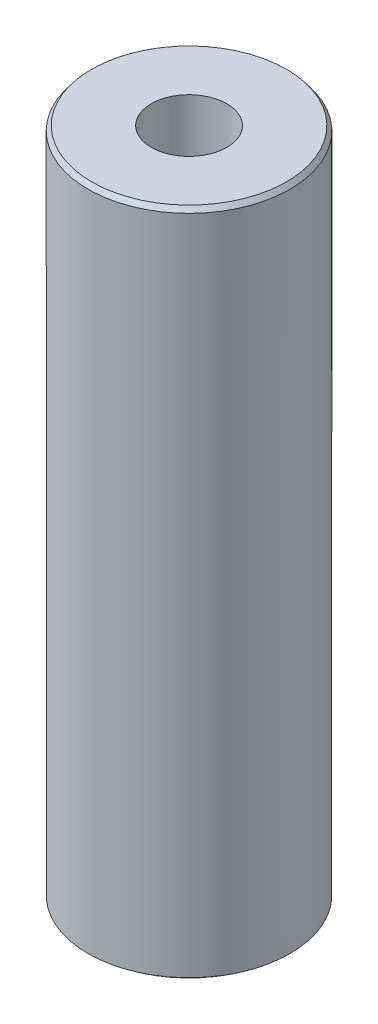
ISO-10303-21;
HEADER;
FILE_DESCRIPTION(('STEP AP214'),'2;1');
FILE_NAME('part.step','',(''),(''),'','','');
FILE_SCHEMA(('AUTOMOTIVE_DESIGN { 1 0 10303 214 1 1 1 1 }'));
ENDSEC;
DATA;
#1=APPLICATION_CONTEXT('core data for automotive mechanical design processes');
#2=APPLICATION_PROTOCOL_DEFINITION('international standard','automotive_design',2000,#1);
#3=PRODUCT_CONTEXT('',#1,'mechanical');
#4=PRODUCT('Part','Part','',(#3));
#5=PRODUCT_RELATED_PRODUCT_CATEGORY('part','',(#4));
#6=PRODUCT_DEFINITION_FORMATION('','',#4);
#7=PRODUCT_DEFINITION_CONTEXT('part definition',#1,'design');
#8=PRODUCT_DEFINITION('design','',#6,#7);
#9=PRODUCT_DEFINITION_SHAPE('','',#8);
#10=(LENGTH_UNIT() NAMED_UNIT(*) SI_UNIT(.MILLI.,.METRE.));
#11=(NAMED_UNIT(*) PLANE_ANGLE_UNIT() SI_UNIT($,.RADIAN.));
#12=(NAMED_UNIT(*) SI_UNIT($,.STERADIAN.) SOLID_ANGLE_UNIT());
#13=UNCERTAINTY_MEASURE_WITH_UNIT(LENGTH_MEASURE(1.E-05),#10,'distance_accuracy_value','');
#14=(GEOMETRIC_REPRESENTATION_CONTEXT(3) GLOBAL_UNCERTAINTY_ASSIGNED_CONTEXT((#13)) GLOBAL_UNIT_ASSIGNED_CONTEXT((#10,
#11,#12)) REPRESENTATION_CONTEXT('',''));
#15=CARTESIAN_POINT('',(0.,0.,0.));
#16=DIRECTION('',(0.,0.,1.));
#17=DIRECTION('',(1.,0.,0.));
#18=AXIS2_PLACEMENT_3D('',#15,#16,#17);
#19=CARTESIAN_POINT('',(0.,298.553097520889,0.));
#20=DIRECTION('',(0.,-1.,0.));
#21=DIRECTION('',(0.,0.,-1.));
#22=AXIS2_PLACEMENT_3D('',#19,#20,#21);
#23=CYLINDRICAL_SURFACE('',#22,45.);
#24=CARTESIAN_POINT('',(0.,296.481665164193,0.));
#25=DIRECTION('',(0.,1.,0.));
#26=DIRECTION('',(0.,0.,1.));
#27=AXIS2_PLACEMENT_3D('',#24,#25,#26);
#28=CIRCLE('',#27,45.);
#29=CARTESIAN_POINT('',(0.,296.481665164193,-45.));
#30=VERTEX_POINT('',#29);
#31=EDGE_CURVE('E50',#30,#30,#28,.F.);
#32=CARTESIAN_POINT('',(0.,1.57807452334624,0.));
#33=DIRECTION('',(0.,1.,0.));
#34=DIRECTION('',(0.,0.,1.));
#35=AXIS2_PLACEMENT_3D('',#32,#33,#34);
#36=CIRCLE('',#35,45.);
#37=CARTESIAN_POINT('',(0.,1.57807452334624,-45.));
#38=VERTEX_POINT('',#37);
#39=EDGE_CURVE('E51',#38,#38,#36,.T.);
#40=CARTESIAN_POINT('',(0.,296.481665164193,-45.));
#41=CARTESIAN_POINT('',(0.,293.409752761684,-45.));
#42=CARTESIAN_POINT('',(0.,290.337840359176,-45.));
#43=CARTESIAN_POINT('',(0.,284.194015554158,-45.));
#44=CARTESIAN_POINT('',(0.,281.122103151649,-45.));
#45=CARTESIAN_POINT('',(0.,274.978278346631,-45.));
#46=CARTESIAN_POINT('',(0.,271.906365944123,-45.));
#47=CARTESIAN_POINT('',(0.,265.762541139105,-45.));
#48=CARTESIAN_POINT('',(0.,262.690628736596,-45.));
#49=CARTESIAN_POINT('',(0.,256.546803931579,-45.));
#50=CARTESIAN_POINT('',(0.,253.47489152907,-45.));
#51=CARTESIAN_POINT('',(0.,247.331066724052,-45.));
#52=CARTESIAN_POINT('',(0.,244.259154321543,-45.));
#53=CARTESIAN_POINT('',(0.,238.115329516526,-45.));
#54=CARTESIAN_POINT('',(0.,235.043417114017,-45.));
#55=CARTESIAN_POINT('',(0.,228.899592308999,-45.));
#56=CARTESIAN_POINT('',(0.,225.82767990649,-45.));
#57=CARTESIAN_POINT('',(0.,219.683855101473,-45.));
#58=CARTESIAN_POINT('',(0.,216.611942698964,-45.));
#59=CARTESIAN_POINT('',(0.,210.468117893946,-45.));
#60=CARTESIAN_POINT('',(0.,207.396205491437,-45.));
#61=CARTESIAN_POINT('',(0.,201.25238068642,-45.));
#62=CARTESIAN_POINT('',(0.,198.180468283911,-45.));
#63=CARTESIAN_POINT('',(0.,192.036643478893,-45.));
#64=CARTESIAN_POINT('',(0.,188.964731076384,-45.));
#65=CARTESIAN_POINT('',(0.,182.820906271367,-45.));
#66=CARTESIAN_POINT('',(0.,179.748993868858,-45.));
#67=CARTESIAN_POINT('',(0.,173.60516906384,-45.));
#68=CARTESIAN_POINT('',(0.,170.533256661331,-45.));
#69=CARTESIAN_POINT('',(0.,164.389431856314,-45.));
#70=CARTESIAN_POINT('',(0.,161.317519453805,-45.));
#71=CARTESIAN_POINT('',(0.,155.173694648787,-45.));
#72=CARTESIAN_POINT('',(0.,152.101782246279,-45.));
#73=CARTESIAN_POINT('',(0.,145.957957441261,-45.));
#74=CARTESIAN_POINT('',(0.,142.886045038752,-45.));
#75=CARTESIAN_POINT('',(0.,136.742220233734,-45.));
#76=CARTESIAN_POINT('',(0.,133.670307831226,-45.));
#77=CARTESIAN_POINT('',(0.,127.526483026208,-45.));
#78=CARTESIAN_POINT('',(0.,124.454570623699,-45.));
#79=CARTESIAN_POINT('',(0.,118.310745818681,-45.));
#80=CARTESIAN_POINT('',(0.,115.238833416173,-45.));
#81=CARTESIAN_POINT('',(0.,109.095008611155,-45.));
#82=CARTESIAN_POINT('',(0.,106.023096208646,-45.));
#83=CARTESIAN_POINT('',(0.,99.8792714036285,-45.));
#84=CARTESIAN_POINT('',(0.,96.8073590011197,-45.));
#85=CARTESIAN_POINT('',(0.,90.663534196102,-45.));
#86=CARTESIAN_POINT('',(0.,87.5916217935932,-45.));
#87=CARTESIAN_POINT('',(0.,81.4477969885756,-45.));
#88=CARTESIAN_POINT('',(0.,78.3758845860668,-45.));
#89=CARTESIAN_POINT('',(0.,72.2320597810491,-45.));
#90=CARTESIAN_POINT('',(0.,69.1601473785403,-45.));
#91=CARTESIAN_POINT('',(0.,63.0163225735226,-45.));
#92=CARTESIAN_POINT('',(0.,59.9444101710138,-45.));
#93=CARTESIAN_POINT('',(0.,53.8005853659962,-45.));
#94=CARTESIAN_POINT('',(0.,50.7286729634874,-45.));
#95=CARTESIAN_POINT('',(0.,44.5848481584697,-45.));
#96=CARTESIAN_POINT('',(0.,41.5129357559609,-45.));
#97=CARTESIAN_POINT('',(0.,35.3691109509433,-45.));
#98=CARTESIAN_POINT('',(0.,32.2971985484345,-45.));
#99=CARTESIAN_POINT('',(0.,26.1533737434168,-45.));
#100=CARTESIAN_POINT('',(0.,23.081461340908,-45.));
#101=CARTESIAN_POINT('',(0.,16.9376365358903,-45.));
#102=CARTESIAN_POINT('',(0.,13.8657241333815,-45.));
#103=CARTESIAN_POINT('',(0.,7.72189932836387,-45.));
#104=CARTESIAN_POINT('',(0.,4.64998692585506,-45.));
#105=CARTESIAN_POINT('',(0.,1.57807452334624,-45.));
#106=B_SPLINE_CURVE_WITH_KNOTS('',3,(#40,#41,#42,#43,#44,#45,#46,#47,#48,#49,#50,#51,#52,#53,
#54,#55,#56,#57,#58,#59,#60,#61,#62,#63,#64,#65,#66,#67,#68,#69,#70,#71,#72,#73,#74,#75,#76,#77,
#78,#79,#80,#81,#82,#83,#84,#85,#86,#87,#88,#89,#90,#91,#92,#93,#94,#95,#96,#97,#98,#99,#100,
#101,#102,#103,#104,#105),.UNSPECIFIED.,.F.,.F.,(4,2,2,2,2,2,2,2,2,2,2,2,2,2,2,2,2,2,2,2,2,2,2,
2,2,2,2,2,2,2,2,2,4),(0.,9.2157372075265,18.4314744150529,27.6472116225794,36.8629488301059,
46.0786860376324,55.2944232451588,64.5101604526853,73.7258976602118,82.9416348677383,
92.1573720752647,101.373109282791,110.588846490318,119.804583697844,129.020320905371,
138.236058112897,147.451795320424,156.66753252795,165.883269735476,175.099006943003,
184.314744150529,193.530481358056,202.746218565582,211.961955773109,221.177692980635,
230.393430188162,239.609167395688,248.824904603215,258.040641810741,267.256379018268,
276.472116225794,285.687853433321,294.903590640847),.UNSPECIFIED.);
#107=EDGE_CURVE('BSEAM39',#30,#38,#106,.T.);
#108=ORIENTED_EDGE('',*,*,#31,.T.);
#109=ORIENTED_EDGE('',*,*,#39,.T.);
#110=ORIENTED_EDGE('',*,*,#107,.T.);
#111=ORIENTED_EDGE('',*,*,#107,.F.);
#112=EDGE_LOOP('',(#108,#110,#109,#111));
#113=FACE_BOUND('',#112,.T.);
#114=ADVANCED_FACE('F39',(#113),#23,.T.);
#115=CARTESIAN_POINT('',(0.,298.553097520889,0.));
#116=DIRECTION('',(0.,1.,0.));
#117=DIRECTION('',(0.,0.,1.));
#118=AXIS2_PLACEMENT_3D('',#115,#116,#117);
#119=PLANE('',#118);
#120=CARTESIAN_POINT('',(0.,298.553097520889,0.));
#121=DIRECTION('',(0.,1.,0.));
#122=DIRECTION('',(0.,0.,1.));
#123=AXIS2_PLACEMENT_3D('',#120,#121,#122);
#124=CIRCLE('',#123,43.4219254766541);
#125=CARTESIAN_POINT('',(0.,298.553097520889,43.4219254766541));
#126=VERTEX_POINT('',#125);
#127=EDGE_CURVE('E54',#126,#126,#124,.T.);
#128=ORIENTED_EDGE('',*,*,#127,.T.);
#129=EDGE_LOOP('',(#128));
#130=FACE_BOUND('',#129,.T.);
#131=CARTESIAN_POINT('',(0.,298.553097520889,0.));
#132=DIRECTION('',(0.,1.,0.));
#133=DIRECTION('',(0.,0.,1.));
#134=AXIS2_PLACEMENT_3D('',#131,#132,#133);
#135=CIRCLE('',#134,16.8477990437032);
#136=CARTESIAN_POINT('',(0.,298.553097520889,-16.8477990437032));
#137=VERTEX_POINT('',#136);
#138=EDGE_CURVE('E58',#137,#137,#135,.T.);
#139=ORIENTED_EDGE('',*,*,#138,.F.);
#140=EDGE_LOOP('',(#139));
#141=FACE_BOUND('',#140,.T.);
#142=ADVANCED_FACE('F69',(#130,#141),#119,.T.);
#143=CARTESIAN_POINT('',(0.,0.,0.));
#144=DIRECTION('',(0.,1.,0.));
#145=DIRECTION('',(0.,0.,1.));
#146=AXIS2_PLACEMENT_3D('',#143,#144,#145);
#147=PLANE('',#146);
#148=CARTESIAN_POINT('',(0.,0.,0.));
#149=DIRECTION('',(0.,1.,0.));
#150=DIRECTION('',(0.,0.,1.));
#151=AXIS2_PLACEMENT_3D('',#148,#149,#150);
#152=CIRCLE('',#151,42.9285676433034);
#153=CARTESIAN_POINT('',(0.,0.,42.9285676433034));
#154=VERTEX_POINT('',#153);
#155=EDGE_CURVE('E10',#154,#154,#152,.F.);
#156=ORIENTED_EDGE('',*,*,#155,.T.);
#157=EDGE_LOOP('',(#156));
#158=FACE_BOUND('',#157,.T.);
#159=CARTESIAN_POINT('',(0.,0.,0.));
#160=DIRECTION('',(0.,1.,0.));
#161=DIRECTION('',(0.,0.,1.));
#162=AXIS2_PLACEMENT_3D('',#159,#160,#161);
#163=CIRCLE('',#162,16.8477990437032);
#164=CARTESIAN_POINT('',(0.,0.,-16.8477990437032));
#165=VERTEX_POINT('',#164);
#166=EDGE_CURVE('E63',#165,#165,#163,.T.);
#167=ORIENTED_EDGE('',*,*,#166,.T.);
#168=EDGE_LOOP('',(#167));
#169=FACE_BOUND('',#168,.T.);
#170=ADVANCED_FACE('F75',(#158,#169),#147,.F.);
#171=CARTESIAN_POINT('',(0.,298.553097520889,0.));
#172=DIRECTION('',(0.,-1.,0.));
#173=DIRECTION('',(0.,0.,-1.));
#174=AXIS2_PLACEMENT_3D('',#171,#172,#173);
#175=CYLINDRICAL_SURFACE('',#174,16.8477990437032);
#176=CARTESIAN_POINT('',(0.,298.553097520889,-16.8477990437032));
#177=CARTESIAN_POINT('',(0.,295.443169421713,-16.8477990437032));
#178=CARTESIAN_POINT('',(0.,292.333241322537,-16.8477990437032));
#179=CARTESIAN_POINT('',(0.,286.113385124186,-16.8477990437032));
#180=CARTESIAN_POINT('',(0.,283.00345702501,-16.8477990437032));
#181=CARTESIAN_POINT('',(0.,276.783600826658,-16.8477990437032));
#182=CARTESIAN_POINT('',(0.,273.673672727482,-16.8477990437032));
#183=CARTESIAN_POINT('',(0.,267.45381652913,-16.8477990437032));
#184=CARTESIAN_POINT('',(0.,264.343888429954,-16.8477990437032));
#185=CARTESIAN_POINT('',(0.,258.124032231602,-16.8477990437032));
#186=CARTESIAN_POINT('',(0.,255.014104132426,-16.8477990437032));
#187=CARTESIAN_POINT('',(0.,248.794247934074,-16.8477990437032));
#188=CARTESIAN_POINT('',(0.,245.684319834899,-16.8477990437032));
#189=CARTESIAN_POINT('',(0.,239.464463636547,-16.8477990437032));
#190=CARTESIAN_POINT('',(0.,236.354535537371,-16.8477990437032));
#191=CARTESIAN_POINT('',(0.,230.134679339019,-16.8477990437032));
#192=CARTESIAN_POINT('',(0.,227.024751239843,-16.8477990437032));
#193=CARTESIAN_POINT('',(0.,220.804895041491,-16.8477990437032));
#194=CARTESIAN_POINT('',(0.,217.694966942315,-16.8477990437032));
#195=CARTESIAN_POINT('',(0.,211.475110743963,-16.8477990437032));
#196=CARTESIAN_POINT('',(0.,208.365182644787,-16.8477990437032));
#197=CARTESIAN_POINT('',(0.,202.145326446436,-16.8477990437032));
#198=CARTESIAN_POINT('',(0.,199.03539834726,-16.8477990437032));
#199=CARTESIAN_POINT('',(0.,192.815542148908,-16.8477990437032));
#200=CARTESIAN_POINT('',(0.,189.705614049732,-16.8477990437032));
#201=CARTESIAN_POINT('',(0.,183.48575785138,-16.8477990437032));
#202=CARTESIAN_POINT('',(0.,180.375829752204,-16.8477990437032));
#203=CARTESIAN_POINT('',(0.,174.155973553852,-16.8477990437032));
#204=CARTESIAN_POINT('',(0.,171.046045454676,-16.8477990437032));
#205=CARTESIAN_POINT('',(0.,164.826189256324,-16.8477990437032));
#206=CARTESIAN_POINT('',(0.,161.716261157148,-16.8477990437032));
#207=CARTESIAN_POINT('',(0.,155.496404958797,-16.8477990437032));
#208=CARTESIAN_POINT('',(0.,152.386476859621,-16.8477990437032));
#209=CARTESIAN_POINT('',(0.,146.166620661269,-16.8477990437032));
#210=CARTESIAN_POINT('',(0.,143.056692562093,-16.8477990437032));
#211=CARTESIAN_POINT('',(0.,136.836836363741,-16.8477990437032));
#212=CARTESIAN_POINT('',(0.,133.726908264565,-16.8477990437032));
#213=CARTESIAN_POINT('',(0.,127.507052066213,-16.8477990437032));
#214=CARTESIAN_POINT('',(0.,124.397123967037,-16.8477990437032));
#215=CARTESIAN_POINT('',(0.,118.177267768685,-16.8477990437032));
#216=CARTESIAN_POINT('',(0.,115.067339669509,-16.8477990437032));
#217=CARTESIAN_POINT('',(0.,108.847483471158,-16.8477990437032));
#218=CARTESIAN_POINT('',(0.,105.737555371982,-16.8477990437032));
#219=CARTESIAN_POINT('',(0.,99.5176991736298,-16.8477990437032));
#220=CARTESIAN_POINT('',(0.,96.4077710744539,-16.8477990437032));
#221=CARTESIAN_POINT('',(0.,90.187914876102,-16.8477990437032));
#222=CARTESIAN_POINT('',(0.,87.0779867769261,-16.8477990437032));
#223=CARTESIAN_POINT('',(0.,80.8581305785742,-16.8477990437032));
#224=CARTESIAN_POINT('',(0.,77.7482024793983,-16.8477990437032));
#225=CARTESIAN_POINT('',(0.,71.5283462810464,-16.8477990437032));
#226=CARTESIAN_POINT('',(0.,68.4184181818705,-16.8477990437032));
#227=CARTESIAN_POINT('',(0.,62.1985619835186,-16.8477990437032));
#228=CARTESIAN_POINT('',(0.,59.0886338843427,-16.8477990437032));
#229=CARTESIAN_POINT('',(0.,52.8687776859908,-16.8477990437032));
#230=CARTESIAN_POINT('',(0.,49.7588495868149,-16.8477990437032));
#231=CARTESIAN_POINT('',(0.,43.538993388463,-16.8477990437032));
#232=CARTESIAN_POINT('',(0.,40.4290652892871,-16.8477990437032));
#233=CARTESIAN_POINT('',(0.,34.2092090909352,-16.8477990437032));
#234=CARTESIAN_POINT('',(0.,31.0992809917593,-16.8477990437032));
#235=CARTESIAN_POINT('',(0.,24.8794247934074,-16.8477990437032));
#236=CARTESIAN_POINT('',(0.,21.7694966942315,-16.8477990437032));
#237=CARTESIAN_POINT('',(0.,15.5496404958796,-16.8477990437032));
#238=CARTESIAN_POINT('',(0.,12.4397123967037,-16.8477990437032));
#239=CARTESIAN_POINT('',(0.,6.21985619835186,-16.8477990437032));
#240=CARTESIAN_POINT('',(0.,3.10992809917593,-16.8477990437032));
#241=CARTESIAN_POINT('',(0.,0.,-16.8477990437032));
#242=B_SPLINE_CURVE_WITH_KNOTS('',3,(#176,#177,#178,#179,#180,#181,#182,#183,#184,#185,#186,
#187,#188,#189,#190,#191,#192,#193,#194,#195,#196,#197,#198,#199,#200,#201,#202,#203,#204,#205,
#206,#207,#208,#209,#210,#211,#212,#213,#214,#215,#216,#217,#218,#219,#220,#221,#222,#223,#224,
#225,#226,#227,#228,#229,#230,#231,#232,#233,#234,#235,#236,#237,#238,#239,#240,#241),
.UNSPECIFIED.,.F.,.F.,(4,2,2,2,2,2,2,2,2,2,2,2,2,2,2,2,2,2,2,2,2,2,2,2,2,2,2,2,2,2,2,2,4),(0.,
9.32978429752779,18.6595685950556,27.9893528925834,37.3191371901111,46.6489214876389,
55.9787057851667,65.3084900826945,74.6382743802223,83.9680586777501,93.2978429752779,
102.627627272806,111.957411570333,121.287195867861,130.616980165389,139.946764462917,
149.276548760445,158.606333057972,167.9361173555,177.265901653028,186.595685950556,
195.925470248084,205.255254545611,214.585038843139,223.914823140667,233.244607438195,
242.574391735723,251.90417603325,261.233960330778,270.563744628306,279.893528925834,
289.223313223362,298.553097520889),.UNSPECIFIED.);
#243=EDGE_CURVE('BSEAM70',#137,#165,#242,.T.);
#244=ORIENTED_EDGE('',*,*,#138,.T.);
#245=ORIENTED_EDGE('',*,*,#166,.F.);
#246=ORIENTED_EDGE('',*,*,#243,.T.);
#247=ORIENTED_EDGE('',*,*,#243,.F.);
#248=EDGE_LOOP('',(#244,#246,#245,#247));
#249=FACE_BOUND('',#248,.T.);
#250=ADVANCED_FACE('F70',(#249),#175,.F.);
#251=CARTESIAN_POINT('',(0.,298.553097520889,0.));
#252=DIRECTION('',(0.,-1.,0.));
#253=DIRECTION('',(0.,0.,-1.));
#254=AXIS2_PLACEMENT_3D('',#251,#252,#253);
#255=CONICAL_SURFACE('',#254,43.4219254766541,0.651027954137122);
#256=ORIENTED_EDGE('',*,*,#31,.F.);
#257=EDGE_LOOP('',(#256));
#258=FACE_BOUND('',#257,.T.);
#259=ORIENTED_EDGE('',*,*,#127,.F.);
#260=EDGE_LOOP('',(#259));
#261=FACE_BOUND('',#260,.T.);
#262=ADVANCED_FACE('F81',(#258,#261),#255,.T.);
#263=CARTESIAN_POINT('',(0.,1.57807452334624,0.));
#264=DIRECTION('',(0.,1.,0.));
#265=DIRECTION('',(0.,0.,1.));
#266=AXIS2_PLACEMENT_3D('',#263,#264,#265);
#267=CONICAL_SURFACE('',#266,45.,0.919768372657785);
#268=ORIENTED_EDGE('',*,*,#155,.F.);
#269=EDGE_LOOP('',(#268));
#270=FACE_BOUND('',#269,.T.);
#271=ORIENTED_EDGE('',*,*,#39,.F.);
#272=EDGE_LOOP('',(#271));
#273=FACE_BOUND('',#272,.T.);
#274=ADVANCED_FACE('F45',(#270,#273),#267,.T.);
#275=CLOSED_SHELL('',(#114,#142,#170,#250,#262,#274));
#276=MANIFOLD_SOLID_BREP('B2',#275);
#277=ADVANCED_BREP_SHAPE_REPRESENTATION('',(#18,#276),#14);
#278=SHAPE_DEFINITION_REPRESENTATION(#9,#277);
ENDSEC;
END-ISO-10303-21;
